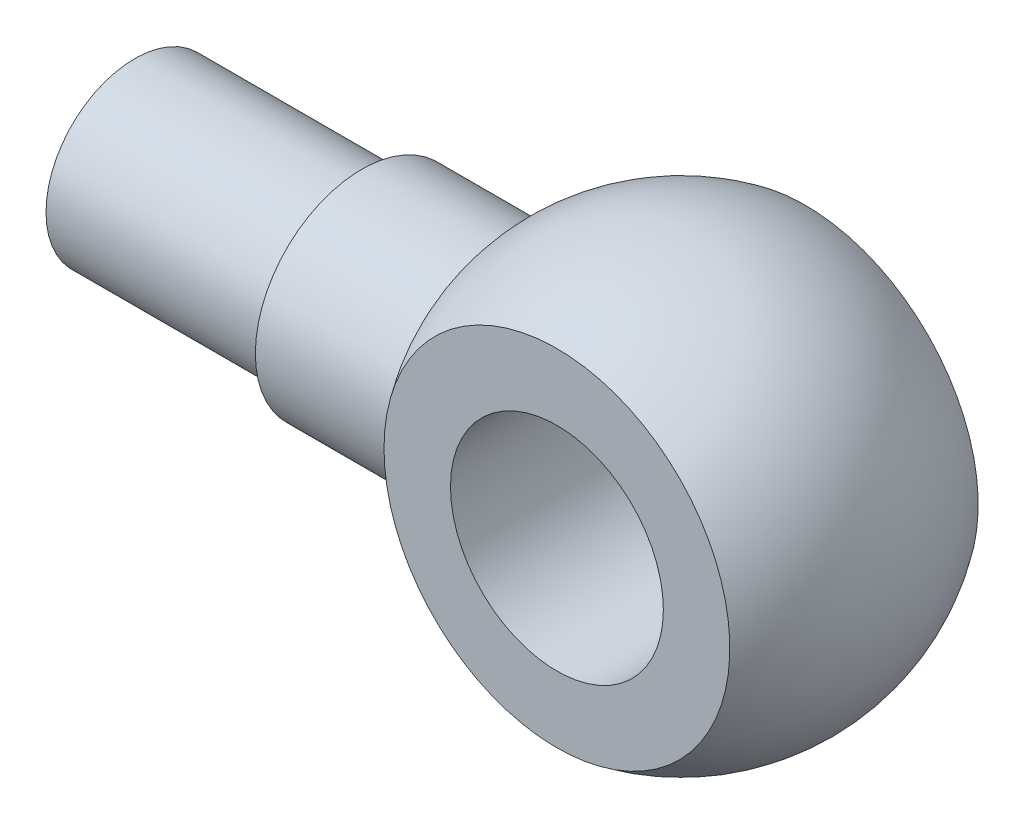
ISO-10303-21;
HEADER;
FILE_DESCRIPTION(('STEP AP214'),'2;1');
FILE_NAME('part.step','',(''),(''),'','','');
FILE_SCHEMA(('AUTOMOTIVE_DESIGN { 1 0 10303 214 1 1 1 1 }'));
ENDSEC;
DATA;
#1=APPLICATION_CONTEXT('core data for automotive mechanical design processes');
#2=APPLICATION_PROTOCOL_DEFINITION('international standard','automotive_design',2000,#1);
#3=PRODUCT_CONTEXT('',#1,'mechanical');
#4=PRODUCT('Part','Part','',(#3));
#5=PRODUCT_RELATED_PRODUCT_CATEGORY('part','',(#4));
#6=PRODUCT_DEFINITION_FORMATION('','',#4);
#7=PRODUCT_DEFINITION_CONTEXT('part definition',#1,'design');
#8=PRODUCT_DEFINITION('design','',#6,#7);
#9=PRODUCT_DEFINITION_SHAPE('','',#8);
#10=(LENGTH_UNIT() NAMED_UNIT(*) SI_UNIT(.MILLI.,.METRE.));
#11=(NAMED_UNIT(*) PLANE_ANGLE_UNIT() SI_UNIT($,.RADIAN.));
#12=(NAMED_UNIT(*) SI_UNIT($,.STERADIAN.) SOLID_ANGLE_UNIT());
#13=UNCERTAINTY_MEASURE_WITH_UNIT(LENGTH_MEASURE(1.E-05),#10,'distance_accuracy_value','');
#14=(GEOMETRIC_REPRESENTATION_CONTEXT(3) GLOBAL_UNCERTAINTY_ASSIGNED_CONTEXT((#13)) GLOBAL_UNIT_ASSIGNED_CONTEXT((#10,
#11,#12)) REPRESENTATION_CONTEXT('',''));
#15=CARTESIAN_POINT('',(0.,0.,0.));
#16=DIRECTION('',(0.,0.,1.));
#17=DIRECTION('',(1.,0.,0.));
#18=AXIS2_PLACEMENT_3D('',#15,#16,#17);
#19=CARTESIAN_POINT('',(0.,0.,0.));
#20=DIRECTION('',(-1.,0.,0.));
#21=DIRECTION('',(0.,0.,1.));
#22=AXIS2_PLACEMENT_3D('',#19,#20,#21);
#23=PLANE('',#22);
#24=CARTESIAN_POINT('',(0.,0.,0.));
#25=DIRECTION('',(-1.,0.,0.));
#26=DIRECTION('',(0.,0.,1.));
#27=AXIS2_PLACEMENT_3D('',#24,#25,#26);
#28=CIRCLE('',#27,12.5);
#29=CARTESIAN_POINT('',(0.,0.,12.5));
#30=VERTEX_POINT('',#29);
#31=EDGE_CURVE('E45',#30,#30,#28,.T.);
#32=ORIENTED_EDGE('',*,*,#31,.T.);
#33=EDGE_LOOP('',(#32));
#34=FACE_BOUND('',#33,.T.);
#35=ADVANCED_FACE('F35',(#34),#23,.T.);
#36=CARTESIAN_POINT('',(-26.278850793323,0.,0.));
#37=DIRECTION('',(-1.,0.,0.));
#38=DIRECTION('',(0.,0.,1.));
#39=AXIS2_PLACEMENT_3D('',#36,#37,#38);
#40=CYLINDRICAL_SURFACE('',#39,15.);
#41=CARTESIAN_POINT('',(51.0192378864668,0.,0.));
#42=DIRECTION('',(1.,0.,0.));
#43=DIRECTION('',(0.,0.,-1.));
#44=AXIS2_PLACEMENT_3D('',#41,#42,#43);
#45=CIRCLE('',#44,15.);
#46=CARTESIAN_POINT('',(51.0192378864668,0.,-15.));
#47=VERTEX_POINT('',#46);
#48=EDGE_CURVE('E49',#47,#47,#45,.T.);
#49=ORIENTED_EDGE('',*,*,#48,.F.);
#50=EDGE_LOOP('',(#49));
#51=FACE_BOUND('',#50,.T.);
#52=CARTESIAN_POINT('',(32.,0.,0.));
#53=DIRECTION('',(-1.,0.,0.));
#54=DIRECTION('',(0.,0.,1.));
#55=AXIS2_PLACEMENT_3D('',#52,#53,#54);
#56=CIRCLE('',#55,15.);
#57=CARTESIAN_POINT('',(32.,0.,15.));
#58=VERTEX_POINT('',#57);
#59=EDGE_CURVE('E10',#58,#58,#56,.T.);
#60=ORIENTED_EDGE('',*,*,#59,.F.);
#61=EDGE_LOOP('',(#60));
#62=FACE_BOUND('',#61,.T.);
#63=ADVANCED_FACE('F87',(#51,#62),#40,.T.);
#64=CARTESIAN_POINT('',(32.,0.,0.));
#65=DIRECTION('',(-1.,0.,0.));
#66=DIRECTION('',(0.,0.,1.));
#67=AXIS2_PLACEMENT_3D('',#64,#65,#66);
#68=PLANE('',#67);
#69=ORIENTED_EDGE('',*,*,#59,.T.);
#70=EDGE_LOOP('',(#69));
#71=FACE_BOUND('',#70,.T.);
#72=CARTESIAN_POINT('',(32.,0.,0.));
#73=DIRECTION('',(-1.,0.,0.));
#74=DIRECTION('',(0.,0.,1.));
#75=AXIS2_PLACEMENT_3D('',#72,#73,#74);
#76=CIRCLE('',#75,12.5);
#77=CARTESIAN_POINT('',(32.,0.,12.5));
#78=VERTEX_POINT('',#77);
#79=EDGE_CURVE('E41',#78,#78,#76,.T.);
#80=ORIENTED_EDGE('',*,*,#79,.F.);
#81=EDGE_LOOP('',(#80));
#82=FACE_BOUND('',#81,.T.);
#83=ADVANCED_FACE('F92',(#71,#82),#68,.T.);
#84=CARTESIAN_POINT('',(-26.278850793323,0.,0.));
#85=DIRECTION('',(-1.,0.,0.));
#86=DIRECTION('',(0.,0.,1.));
#87=AXIS2_PLACEMENT_3D('',#84,#85,#86);
#88=CYLINDRICAL_SURFACE('',#87,12.5);
#89=ORIENTED_EDGE('',*,*,#79,.T.);
#90=EDGE_LOOP('',(#89));
#91=FACE_BOUND('',#90,.T.);
#92=ORIENTED_EDGE('',*,*,#31,.F.);
#93=EDGE_LOOP('',(#92));
#94=FACE_BOUND('',#93,.T.);
#95=ADVANCED_FACE('F96',(#91,#94),#88,.T.);
#96=CARTESIAN_POINT('',(77.,0.,0.));
#97=DIRECTION('',(0.,0.,-1.));
#98=DIRECTION('',(1.,0.,0.));
#99=AXIS2_PLACEMENT_3D('',#96,#97,#98);
#100=SPHERICAL_SURFACE('',#99,30.);
#101=ORIENTED_EDGE('',*,*,#48,.T.);
#102=EDGE_LOOP('',(#101));
#103=FACE_BOUND('',#102,.T.);
#104=CARTESIAN_POINT('',(77.,0.,17.5));
#105=DIRECTION('',(0.,0.,-1.));
#106=DIRECTION('',(-1.,0.,0.));
#107=AXIS2_PLACEMENT_3D('',#104,#105,#106);
#108=CIRCLE('',#107,24.3669858620224);
#109=CARTESIAN_POINT('',(52.6330141379776,0.,17.5));
#110=VERTEX_POINT('',#109);
#111=EDGE_CURVE('E63',#110,#110,#108,.T.);
#112=ORIENTED_EDGE('',*,*,#111,.T.);
#113=EDGE_LOOP('',(#112));
#114=FACE_BOUND('',#113,.T.);
#115=CARTESIAN_POINT('',(77.,0.,-17.5));
#116=DIRECTION('',(0.,0.,-1.));
#117=DIRECTION('',(-1.,0.,0.));
#118=AXIS2_PLACEMENT_3D('',#115,#116,#117);
#119=CIRCLE('',#118,24.3669858620224);
#120=CARTESIAN_POINT('',(52.6330141379776,0.,-17.5));
#121=VERTEX_POINT('',#120);
#122=EDGE_CURVE('E54',#121,#121,#119,.T.);
#123=ORIENTED_EDGE('',*,*,#122,.F.);
#124=EDGE_LOOP('',(#123));
#125=FACE_BOUND('',#124,.T.);
#126=ADVANCED_FACE('F67',(#103,#114,#125),#100,.T.);
#127=CARTESIAN_POINT('',(0.,0.,-17.5));
#128=DIRECTION('',(0.,0.,-1.));
#129=DIRECTION('',(-1.,0.,0.));
#130=AXIS2_PLACEMENT_3D('',#127,#128,#129);
#131=PLANE('',#130);
#132=ORIENTED_EDGE('',*,*,#122,.T.);
#133=EDGE_LOOP('',(#132));
#134=FACE_BOUND('',#133,.T.);
#135=CARTESIAN_POINT('',(77.,0.,-17.5));
#136=DIRECTION('',(0.,0.,-1.));
#137=DIRECTION('',(-1.,0.,0.));
#138=AXIS2_PLACEMENT_3D('',#135,#136,#137);
#139=CIRCLE('',#138,15.);
#140=CARTESIAN_POINT('',(62.,0.,-17.5));
#141=VERTEX_POINT('',#140);
#142=EDGE_CURVE('E57',#141,#141,#139,.T.);
#143=ORIENTED_EDGE('',*,*,#142,.F.);
#144=EDGE_LOOP('',(#143));
#145=FACE_BOUND('',#144,.T.);
#146=ADVANCED_FACE('F78',(#134,#145),#131,.T.);
#147=CARTESIAN_POINT('',(77.,0.,-76.1520734337587));
#148=DIRECTION('',(0.,0.,-1.));
#149=DIRECTION('',(-1.,0.,0.));
#150=AXIS2_PLACEMENT_3D('',#147,#148,#149);
#151=CYLINDRICAL_SURFACE('',#150,15.);
#152=ORIENTED_EDGE('',*,*,#142,.T.);
#153=EDGE_LOOP('',(#152));
#154=FACE_BOUND('',#153,.T.);
#155=CARTESIAN_POINT('',(77.,0.,17.5));
#156=DIRECTION('',(0.,0.,-1.));
#157=DIRECTION('',(-1.,0.,0.));
#158=AXIS2_PLACEMENT_3D('',#155,#156,#157);
#159=CIRCLE('',#158,15.);
#160=CARTESIAN_POINT('',(62.,0.,17.5));
#161=VERTEX_POINT('',#160);
#162=EDGE_CURVE('E60',#161,#161,#159,.T.);
#163=ORIENTED_EDGE('',*,*,#162,.F.);
#164=EDGE_LOOP('',(#163));
#165=FACE_BOUND('',#164,.T.);
#166=ADVANCED_FACE('F73',(#154,#165),#151,.F.);
#167=CARTESIAN_POINT('',(0.,0.,17.5));
#168=DIRECTION('',(0.,0.,-1.));
#169=DIRECTION('',(-1.,0.,0.));
#170=AXIS2_PLACEMENT_3D('',#167,#168,#169);
#171=PLANE('',#170);
#172=ORIENTED_EDGE('',*,*,#111,.F.);
#173=EDGE_LOOP('',(#172));
#174=FACE_BOUND('',#173,.T.);
#175=ORIENTED_EDGE('',*,*,#162,.T.);
#176=EDGE_LOOP('',(#175));
#177=FACE_BOUND('',#176,.T.);
#178=ADVANCED_FACE('F70',(#174,#177),#171,.F.);
#179=CLOSED_SHELL('',(#35,#63,#83,#95,#126,#146,#166,#178));
#180=MANIFOLD_SOLID_BREP('B2',#179);
#181=ADVANCED_BREP_SHAPE_REPRESENTATION('',(#18,#180),#14);
#182=SHAPE_DEFINITION_REPRESENTATION(#9,#181);
ENDSEC;
END-ISO-10303-21;
